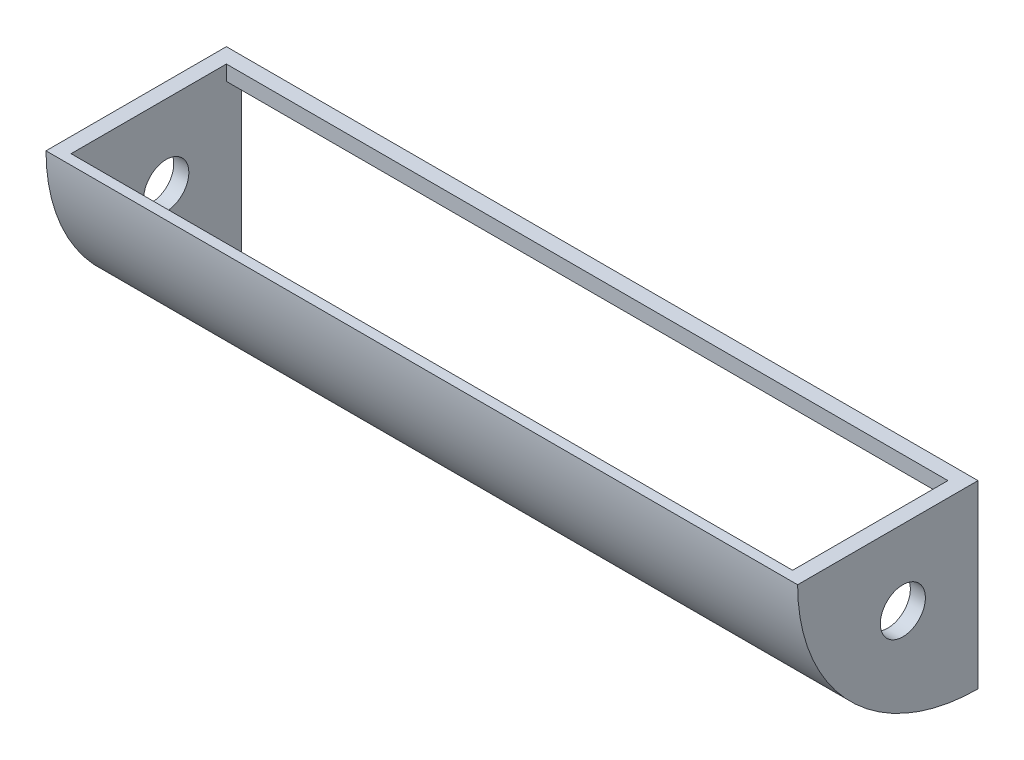
ISO-10303-21;
HEADER;
FILE_DESCRIPTION(('STEP AP214'),'2;1');
FILE_NAME('part.step','',(''),(''),'','','');
FILE_SCHEMA(('AUTOMOTIVE_DESIGN { 1 0 10303 214 1 1 1 1 }'));
ENDSEC;
DATA;
#1=APPLICATION_CONTEXT('core data for automotive mechanical design processes');
#2=APPLICATION_PROTOCOL_DEFINITION('international standard','automotive_design',2000,#1);
#3=PRODUCT_CONTEXT('',#1,'mechanical');
#4=PRODUCT('Part','Part','',(#3));
#5=PRODUCT_RELATED_PRODUCT_CATEGORY('part','',(#4));
#6=PRODUCT_DEFINITION_FORMATION('','',#4);
#7=PRODUCT_DEFINITION_CONTEXT('part definition',#1,'design');
#8=PRODUCT_DEFINITION('design','',#6,#7);
#9=PRODUCT_DEFINITION_SHAPE('','',#8);
#10=(LENGTH_UNIT() NAMED_UNIT(*) SI_UNIT(.MILLI.,.METRE.));
#11=(NAMED_UNIT(*) PLANE_ANGLE_UNIT() SI_UNIT($,.RADIAN.));
#12=(NAMED_UNIT(*) SI_UNIT($,.STERADIAN.) SOLID_ANGLE_UNIT());
#13=UNCERTAINTY_MEASURE_WITH_UNIT(LENGTH_MEASURE(1.E-05),#10,'distance_accuracy_value','');
#14=(GEOMETRIC_REPRESENTATION_CONTEXT(3) GLOBAL_UNCERTAINTY_ASSIGNED_CONTEXT((#13)) GLOBAL_UNIT_ASSIGNED_CONTEXT((#10,
#11,#12)) REPRESENTATION_CONTEXT('',''));
#15=CARTESIAN_POINT('',(0.,0.,0.));
#16=DIRECTION('',(0.,0.,1.));
#17=DIRECTION('',(1.,0.,0.));
#18=AXIS2_PLACEMENT_3D('',#15,#16,#17);
#19=CARTESIAN_POINT('',(25.4,0.,0.));
#20=DIRECTION('',(1.,0.,0.));
#21=DIRECTION('',(0.,0.,-1.));
#22=AXIS2_PLACEMENT_3D('',#19,#20,#21);
#23=PLANE('',#22);
#24=CARTESIAN_POINT('',(25.4,-127.,127.));
#25=DIRECTION('',(1.,0.,0.));
#26=DIRECTION('',(0.,0.,-1.));
#27=AXIS2_PLACEMENT_3D('',#24,#25,#26);
#28=CIRCLE('',#27,38.1);
#29=CARTESIAN_POINT('',(25.3999999999999,-127.,165.1));
#30=VERTEX_POINT('',#29);
#31=EDGE_CURVE('E159',#30,#30,#28,.T.);
#32=ORIENTED_EDGE('',*,*,#31,.F.);
#33=EDGE_LOOP('',(#32));
#34=FACE_BOUND('',#33,.T.);
#35=CARTESIAN_POINT('',(25.4,0.,0.));
#36=DIRECTION('',(-1.,0.,0.));
#37=DIRECTION('',(0.,0.,-1.));
#38=AXIS2_PLACEMENT_3D('',#35,#36,#37);
#39=CIRCLE('',#38,287.848767291767);
#40=CARTESIAN_POINT('',(25.4,-279.4,69.2282661301731));
#41=VERTEX_POINT('',#40);
#42=CARTESIAN_POINT('',(25.4,0.,287.848767291767));
#43=VERTEX_POINT('',#42);
#44=EDGE_CURVE('E48',#41,#43,#39,.T.);
#45=ORIENTED_EDGE('',*,*,#44,.F.);
#46=DIRECTION('',(0.,1.,0.));
#47=VECTOR('',#46,1.);
#48=CARTESIAN_POINT('',(25.4,-279.4,69.228266130173));
#49=LINE('',#48,#47);
#50=CARTESIAN_POINT('',(25.4,-296.834107151806,69.228266130173));
#51=VERTEX_POINT('',#50);
#52=EDGE_CURVE('E52',#51,#41,#49,.T.);
#53=ORIENTED_EDGE('',*,*,#52,.F.);
#54=CARTESIAN_POINT('',(25.4,0.,0.));
#55=DIRECTION('',(1.,0.,0.));
#56=DIRECTION('',(0.,0.,-1.));
#57=AXIS2_PLACEMENT_3D('',#54,#55,#56);
#58=CIRCLE('',#57,304.8);
#59=CARTESIAN_POINT('',(25.4,-304.8,0.));
#60=VERTEX_POINT('',#59);
#61=EDGE_CURVE('E191',#51,#60,#58,.T.);
#62=ORIENTED_EDGE('',*,*,#61,.T.);
#63=DIRECTION('',(0.,1.,0.));
#64=VECTOR('',#63,1.);
#65=CARTESIAN_POINT('',(25.4,0.,0.));
#66=LINE('',#65,#64);
#67=CARTESIAN_POINT('',(25.4,-25.4,0.));
#68=VERTEX_POINT('',#67);
#69=EDGE_CURVE('E186',#60,#68,#66,.T.);
#70=ORIENTED_EDGE('',*,*,#69,.T.);
#71=DIRECTION('',(0.,0.,-1.));
#72=VECTOR('',#71,1.);
#73=CARTESIAN_POINT('',(25.4,-25.4,0.));
#74=LINE('',#73,#72);
#75=CARTESIAN_POINT('',(25.4,-25.4,25.4));
#76=VERTEX_POINT('',#75);
#77=EDGE_CURVE('E174',#76,#68,#74,.T.);
#78=ORIENTED_EDGE('',*,*,#77,.F.);
#79=DIRECTION('',(0.,-1.,0.));
#80=VECTOR('',#79,1.);
#81=CARTESIAN_POINT('',(25.4,0.,25.4));
#82=LINE('',#81,#80);
#83=CARTESIAN_POINT('',(25.4,0.,25.4));
#84=VERTEX_POINT('',#83);
#85=EDGE_CURVE('E171',#84,#76,#82,.T.);
#86=ORIENTED_EDGE('',*,*,#85,.F.);
#87=DIRECTION('',(0.,0.,1.));
#88=VECTOR('',#87,1.);
#89=CARTESIAN_POINT('',(25.4,0.,0.));
#90=LINE('',#89,#88);
#91=EDGE_CURVE('E188',#84,#43,#90,.T.);
#92=ORIENTED_EDGE('',*,*,#91,.T.);
#93=EDGE_LOOP('',(#45,#53,#62,#70,#78,#86,#92));
#94=FACE_BOUND('',#93,.T.);
#95=ADVANCED_FACE('F33',(#34,#94),#23,.T.);
#96=CARTESIAN_POINT('',(25.4,0.,0.));
#97=DIRECTION('',(0.,0.,1.));
#98=DIRECTION('',(1.,0.,0.));
#99=AXIS2_PLACEMENT_3D('',#96,#97,#98);
#100=PLANE('',#99);
#101=DIRECTION('',(0.,1.,0.));
#102=VECTOR('',#101,1.);
#103=CARTESIAN_POINT('',(0.,0.,0.));
#104=LINE('',#103,#102);
#105=CARTESIAN_POINT('',(0.,-304.8,0.));
#106=VERTEX_POINT('',#105);
#107=CARTESIAN_POINT('',(0.,0.,0.));
#108=VERTEX_POINT('',#107);
#109=EDGE_CURVE('E185',#106,#108,#104,.T.);
#110=ORIENTED_EDGE('',*,*,#109,.T.);
#111=DIRECTION('',(-1.,0.,0.));
#112=VECTOR('',#111,1.);
#113=CARTESIAN_POINT('',(25.4,0.,0.));
#114=LINE('',#113,#112);
#115=CARTESIAN_POINT('',(1270.,0.,0.));
#116=VERTEX_POINT('',#115);
#117=EDGE_CURVE('E11',#116,#108,#114,.T.);
#118=ORIENTED_EDGE('',*,*,#117,.F.);
#119=DIRECTION('',(0.,1.,0.));
#120=VECTOR('',#119,1.);
#121=CARTESIAN_POINT('',(1270.,0.,0.));
#122=LINE('',#121,#120);
#123=CARTESIAN_POINT('',(1270.,-304.8,0.));
#124=VERTEX_POINT('',#123);
#125=EDGE_CURVE('E127',#124,#116,#122,.T.);
#126=ORIENTED_EDGE('',*,*,#125,.F.);
#127=DIRECTION('',(1.,0.,0.));
#128=VECTOR('',#127,1.);
#129=CARTESIAN_POINT('',(1244.6,-304.8,0.));
#130=LINE('',#129,#128);
#131=CARTESIAN_POINT('',(1244.6,-304.8,0.));
#132=VERTEX_POINT('',#131);
#133=EDGE_CURVE('E111',#132,#124,#130,.T.);
#134=ORIENTED_EDGE('',*,*,#133,.F.);
#135=DIRECTION('',(0.,1.,0.));
#136=VECTOR('',#135,1.);
#137=CARTESIAN_POINT('',(1244.6,0.,0.));
#138=LINE('',#137,#136);
#139=CARTESIAN_POINT('',(1244.6,-25.4,0.));
#140=VERTEX_POINT('',#139);
#141=EDGE_CURVE('E120',#132,#140,#138,.T.);
#142=ORIENTED_EDGE('',*,*,#141,.T.);
#143=DIRECTION('',(-1.,0.,0.));
#144=VECTOR('',#143,1.);
#145=CARTESIAN_POINT('',(635.,-25.4,0.));
#146=LINE('',#145,#144);
#147=EDGE_CURVE('E177',#140,#68,#146,.T.);
#148=ORIENTED_EDGE('',*,*,#147,.T.);
#149=ORIENTED_EDGE('',*,*,#69,.F.);
#150=DIRECTION('',(-1.,0.,0.));
#151=VECTOR('',#150,1.);
#152=CARTESIAN_POINT('',(25.4,-304.8,0.));
#153=LINE('',#152,#151);
#154=EDGE_CURVE('E193',#60,#106,#153,.T.);
#155=ORIENTED_EDGE('',*,*,#154,.T.);
#156=EDGE_LOOP('',(#110,#118,#126,#134,#142,#148,#149,#155));
#157=FACE_BOUND('',#156,.T.);
#158=ADVANCED_FACE('F35',(#157),#100,.F.);
#159=CARTESIAN_POINT('',(25.4,0.,0.));
#160=DIRECTION('',(0.,-1.,0.));
#161=DIRECTION('',(0.,0.,-1.));
#162=AXIS2_PLACEMENT_3D('',#159,#160,#161);
#163=PLANE('',#162);
#164=DIRECTION('',(-1.,0.,0.));
#165=VECTOR('',#164,1.);
#166=CARTESIAN_POINT('',(635.,0.,25.4));
#167=LINE('',#166,#165);
#168=CARTESIAN_POINT('',(1244.6,0.,25.4));
#169=VERTEX_POINT('',#168);
#170=EDGE_CURVE('E182',#169,#84,#167,.T.);
#171=ORIENTED_EDGE('',*,*,#170,.F.);
#172=DIRECTION('',(0.,0.,1.));
#173=VECTOR('',#172,1.);
#174=CARTESIAN_POINT('',(1244.6,0.,0.));
#175=LINE('',#174,#173);
#176=CARTESIAN_POINT('',(1244.6,0.,287.848767291767));
#177=VERTEX_POINT('',#176);
#178=EDGE_CURVE('E119',#169,#177,#175,.T.);
#179=ORIENTED_EDGE('',*,*,#178,.T.);
#180=DIRECTION('',(-1.,0.,0.));
#181=VECTOR('',#180,1.);
#182=CARTESIAN_POINT('',(635.,0.,287.848767291767));
#183=LINE('',#182,#181);
#184=EDGE_CURVE('E164',#177,#43,#183,.T.);
#185=ORIENTED_EDGE('',*,*,#184,.T.);
#186=ORIENTED_EDGE('',*,*,#91,.F.);
#187=EDGE_LOOP('',(#171,#179,#185,#186));
#188=FACE_BOUND('',#187,.T.);
#189=DIRECTION('',(0.,0.,1.));
#190=VECTOR('',#189,1.);
#191=CARTESIAN_POINT('',(0.,0.,0.));
#192=LINE('',#191,#190);
#193=CARTESIAN_POINT('',(0.,0.,304.8));
#194=VERTEX_POINT('',#193);
#195=EDGE_CURVE('E195',#108,#194,#192,.T.);
#196=ORIENTED_EDGE('',*,*,#195,.T.);
#197=DIRECTION('',(-1.,0.,0.));
#198=VECTOR('',#197,1.);
#199=CARTESIAN_POINT('',(25.4,0.,304.8));
#200=LINE('',#199,#198);
#201=CARTESIAN_POINT('',(1270.,0.,304.8));
#202=VERTEX_POINT('',#201);
#203=EDGE_CURVE('E41',#202,#194,#200,.T.);
#204=ORIENTED_EDGE('',*,*,#203,.F.);
#205=DIRECTION('',(0.,0.,1.));
#206=VECTOR('',#205,1.);
#207=CARTESIAN_POINT('',(1270.,0.,0.));
#208=LINE('',#207,#206);
#209=EDGE_CURVE('E136',#116,#202,#208,.T.);
#210=ORIENTED_EDGE('',*,*,#209,.F.);
#211=ORIENTED_EDGE('',*,*,#117,.T.);
#212=EDGE_LOOP('',(#196,#204,#210,#211));
#213=FACE_BOUND('',#212,.T.);
#214=ADVANCED_FACE('F215',(#188,#213),#163,.F.);
#215=CARTESIAN_POINT('',(25.4,0.,0.));
#216=DIRECTION('',(-1.,0.,0.));
#217=DIRECTION('',(0.,0.,1.));
#218=AXIS2_PLACEMENT_3D('',#215,#216,#217);
#219=CYLINDRICAL_SURFACE('',#218,304.8);
#220=CARTESIAN_POINT('',(0.,0.,0.));
#221=DIRECTION('',(1.,0.,0.));
#222=DIRECTION('',(0.,0.,-1.));
#223=AXIS2_PLACEMENT_3D('',#220,#221,#222);
#224=CIRCLE('',#223,304.8);
#225=EDGE_CURVE('E189',#194,#106,#224,.T.);
#226=ORIENTED_EDGE('',*,*,#225,.T.);
#227=ORIENTED_EDGE('',*,*,#154,.F.);
#228=ORIENTED_EDGE('',*,*,#61,.F.);
#229=DIRECTION('',(-1.,0.,0.));
#230=VECTOR('',#229,1.);
#231=CARTESIAN_POINT('',(635.,-296.834107151806,69.228266130173));
#232=LINE('',#231,#230);
#233=CARTESIAN_POINT('',(1244.6,-296.834107151806,69.228266130173));
#234=VERTEX_POINT('',#233);
#235=EDGE_CURVE('E114',#234,#51,#232,.T.);
#236=ORIENTED_EDGE('',*,*,#235,.F.);
#237=CARTESIAN_POINT('',(1244.6,0.,0.));
#238=DIRECTION('',(1.,0.,0.));
#239=DIRECTION('',(0.,0.,-1.));
#240=AXIS2_PLACEMENT_3D('',#237,#238,#239);
#241=CIRCLE('',#240,304.8);
#242=EDGE_CURVE('E107',#234,#132,#241,.T.);
#243=ORIENTED_EDGE('',*,*,#242,.T.);
#244=ORIENTED_EDGE('',*,*,#133,.T.);
#245=CARTESIAN_POINT('',(1270.,0.,0.));
#246=DIRECTION('',(1.,0.,0.));
#247=DIRECTION('',(0.,0.,-1.));
#248=AXIS2_PLACEMENT_3D('',#245,#246,#247);
#249=CIRCLE('',#248,304.8);
#250=EDGE_CURVE('E139',#202,#124,#249,.T.);
#251=ORIENTED_EDGE('',*,*,#250,.F.);
#252=ORIENTED_EDGE('',*,*,#203,.T.);
#253=EDGE_LOOP('',(#226,#227,#228,#236,#243,#244,#251,#252));
#254=FACE_BOUND('',#253,.T.);
#255=ADVANCED_FACE('F109',(#254),#219,.T.);
#256=CARTESIAN_POINT('',(0.,0.,0.));
#257=DIRECTION('',(1.,0.,0.));
#258=DIRECTION('',(0.,0.,-1.));
#259=AXIS2_PLACEMENT_3D('',#256,#257,#258);
#260=PLANE('',#259);
#261=CARTESIAN_POINT('',(0.,-127.,127.));
#262=DIRECTION('',(-1.,0.,0.));
#263=DIRECTION('',(0.,0.,1.));
#264=AXIS2_PLACEMENT_3D('',#261,#262,#263);
#265=CIRCLE('',#264,38.1);
#266=CARTESIAN_POINT('',(0.,-127.,165.1));
#267=VERTEX_POINT('',#266);
#268=EDGE_CURVE('E156',#267,#267,#265,.T.);
#269=ORIENTED_EDGE('',*,*,#268,.F.);
#270=EDGE_LOOP('',(#269));
#271=FACE_BOUND('',#270,.T.);
#272=ORIENTED_EDGE('',*,*,#109,.F.);
#273=ORIENTED_EDGE('',*,*,#225,.F.);
#274=ORIENTED_EDGE('',*,*,#195,.F.);
#275=EDGE_LOOP('',(#272,#273,#274));
#276=FACE_BOUND('',#275,.T.);
#277=ADVANCED_FACE('F206',(#271,#276),#260,.F.);
#278=CARTESIAN_POINT('',(635.,0.,25.4));
#279=DIRECTION('',(0.,0.,-1.));
#280=DIRECTION('',(0.,1.,0.));
#281=AXIS2_PLACEMENT_3D('',#278,#279,#280);
#282=PLANE('',#281);
#283=ORIENTED_EDGE('',*,*,#85,.T.);
#284=DIRECTION('',(-1.,0.,0.));
#285=VECTOR('',#284,1.);
#286=CARTESIAN_POINT('',(635.,-25.4,25.4));
#287=LINE('',#286,#285);
#288=CARTESIAN_POINT('',(1244.6,-25.4,25.4));
#289=VERTEX_POINT('',#288);
#290=EDGE_CURVE('E179',#289,#76,#287,.T.);
#291=ORIENTED_EDGE('',*,*,#290,.F.);
#292=DIRECTION('',(0.,-1.,0.));
#293=VECTOR('',#292,1.);
#294=CARTESIAN_POINT('',(1244.6,0.,25.4));
#295=LINE('',#294,#293);
#296=EDGE_CURVE('E154',#169,#289,#295,.T.);
#297=ORIENTED_EDGE('',*,*,#296,.F.);
#298=ORIENTED_EDGE('',*,*,#170,.T.);
#299=EDGE_LOOP('',(#283,#291,#297,#298));
#300=FACE_BOUND('',#299,.T.);
#301=ADVANCED_FACE('F218',(#300),#282,.F.);
#302=CARTESIAN_POINT('',(635.,-25.4,0.));
#303=DIRECTION('',(0.,1.,0.));
#304=DIRECTION('',(0.,0.,1.));
#305=AXIS2_PLACEMENT_3D('',#302,#303,#304);
#306=PLANE('',#305);
#307=ORIENTED_EDGE('',*,*,#77,.T.);
#308=ORIENTED_EDGE('',*,*,#147,.F.);
#309=DIRECTION('',(0.,0.,-1.));
#310=VECTOR('',#309,1.);
#311=CARTESIAN_POINT('',(1244.6,-25.4,0.));
#312=LINE('',#311,#310);
#313=EDGE_CURVE('E135',#289,#140,#312,.T.);
#314=ORIENTED_EDGE('',*,*,#313,.F.);
#315=ORIENTED_EDGE('',*,*,#290,.T.);
#316=EDGE_LOOP('',(#307,#308,#314,#315));
#317=FACE_BOUND('',#316,.T.);
#318=ADVANCED_FACE('F220',(#317),#306,.F.);
#319=CARTESIAN_POINT('',(635.,-279.4,69.228266130173));
#320=DIRECTION('',(0.,0.,1.));
#321=DIRECTION('',(1.,0.,0.));
#322=AXIS2_PLACEMENT_3D('',#319,#320,#321);
#323=PLANE('',#322);
#324=ORIENTED_EDGE('',*,*,#52,.T.);
#325=DIRECTION('',(-1.,0.,0.));
#326=VECTOR('',#325,1.);
#327=CARTESIAN_POINT('',(635.,-279.4,69.2282661301731));
#328=LINE('',#327,#326);
#329=CARTESIAN_POINT('',(1244.6,-279.4,69.2282661301731));
#330=VERTEX_POINT('',#329);
#331=EDGE_CURVE('E167',#330,#41,#328,.T.);
#332=ORIENTED_EDGE('',*,*,#331,.F.);
#333=DIRECTION('',(0.,1.,0.));
#334=VECTOR('',#333,1.);
#335=CARTESIAN_POINT('',(1244.6,-279.4,69.228266130173));
#336=LINE('',#335,#334);
#337=EDGE_CURVE('E151',#234,#330,#336,.T.);
#338=ORIENTED_EDGE('',*,*,#337,.F.);
#339=ORIENTED_EDGE('',*,*,#235,.T.);
#340=EDGE_LOOP('',(#324,#332,#338,#339));
#341=FACE_BOUND('',#340,.T.);
#342=ADVANCED_FACE('F209',(#341),#323,.F.);
#343=CARTESIAN_POINT('',(635.,0.,0.));
#344=DIRECTION('',(-1.,0.,0.));
#345=DIRECTION('',(0.,0.,1.));
#346=AXIS2_PLACEMENT_3D('',#343,#344,#345);
#347=CYLINDRICAL_SURFACE('',#346,287.848767291767);
#348=ORIENTED_EDGE('',*,*,#44,.T.);
#349=ORIENTED_EDGE('',*,*,#184,.F.);
#350=CARTESIAN_POINT('',(1244.6,0.,0.));
#351=DIRECTION('',(-1.,0.,0.));
#352=DIRECTION('',(0.,0.,-1.));
#353=AXIS2_PLACEMENT_3D('',#350,#351,#352);
#354=CIRCLE('',#353,287.848767291767);
#355=EDGE_CURVE('E129',#330,#177,#354,.T.);
#356=ORIENTED_EDGE('',*,*,#355,.F.);
#357=ORIENTED_EDGE('',*,*,#331,.T.);
#358=EDGE_LOOP('',(#348,#349,#356,#357));
#359=FACE_BOUND('',#358,.T.);
#360=ADVANCED_FACE('F221',(#359),#347,.F.);
#361=CARTESIAN_POINT('',(609.6,-127.,127.));
#362=DIRECTION('',(-1.,0.,0.));
#363=DIRECTION('',(0.,0.,1.));
#364=AXIS2_PLACEMENT_3D('',#361,#362,#363);
#365=CYLINDRICAL_SURFACE('',#364,38.1);
#366=CARTESIAN_POINT('',(25.3999999999999,-127.,165.1));
#367=CARTESIAN_POINT('',(25.1354166666665,-127.,165.1));
#368=CARTESIAN_POINT('',(24.8708333333332,-127.,165.1));
#369=CARTESIAN_POINT('',(24.3416666666665,-127.,165.1));
#370=CARTESIAN_POINT('',(24.0770833333332,-127.,165.1));
#371=CARTESIAN_POINT('',(23.5479166666666,-127.,165.1));
#372=CARTESIAN_POINT('',(23.2833333333332,-127.,165.1));
#373=CARTESIAN_POINT('',(22.7541666666666,-127.,165.1));
#374=CARTESIAN_POINT('',(22.4895833333332,-127.,165.1));
#375=CARTESIAN_POINT('',(21.9604166666666,-127.,165.1));
#376=CARTESIAN_POINT('',(21.6958333333332,-127.,165.1));
#377=CARTESIAN_POINT('',(21.1666666666666,-127.,165.1));
#378=CARTESIAN_POINT('',(20.9020833333332,-127.,165.1));
#379=CARTESIAN_POINT('',(20.3729166666666,-127.,165.1));
#380=CARTESIAN_POINT('',(20.1083333333332,-127.,165.1));
#381=CARTESIAN_POINT('',(19.5791666666666,-127.,165.1));
#382=CARTESIAN_POINT('',(19.3145833333332,-127.,165.1));
#383=CARTESIAN_POINT('',(18.7854166666666,-127.,165.1));
#384=CARTESIAN_POINT('',(18.5208333333332,-127.,165.1));
#385=CARTESIAN_POINT('',(17.9916666666666,-127.,165.1));
#386=CARTESIAN_POINT('',(17.7270833333332,-127.,165.1));
#387=CARTESIAN_POINT('',(17.1979166666666,-127.,165.1));
#388=CARTESIAN_POINT('',(16.9333333333332,-127.,165.1));
#389=CARTESIAN_POINT('',(16.4041666666666,-127.,165.1));
#390=CARTESIAN_POINT('',(16.1395833333332,-127.,165.1));
#391=CARTESIAN_POINT('',(15.6104166666666,-127.,165.1));
#392=CARTESIAN_POINT('',(15.3458333333332,-127.,165.1));
#393=CARTESIAN_POINT('',(14.8166666666666,-127.,165.1));
#394=CARTESIAN_POINT('',(14.5520833333332,-127.,165.1));
#395=CARTESIAN_POINT('',(14.0229166666666,-127.,165.1));
#396=CARTESIAN_POINT('',(13.7583333333333,-127.,165.1));
#397=CARTESIAN_POINT('',(13.2291666666666,-127.,165.1));
#398=CARTESIAN_POINT('',(12.9645833333333,-127.,165.1));
#399=CARTESIAN_POINT('',(12.4354166666666,-127.,165.1));
#400=CARTESIAN_POINT('',(12.1708333333332,-127.,165.1));
#401=CARTESIAN_POINT('',(11.6416666666666,-127.,165.1));
#402=CARTESIAN_POINT('',(11.3770833333333,-127.,165.1));
#403=CARTESIAN_POINT('',(10.8479166666666,-127.,165.1));
#404=CARTESIAN_POINT('',(10.5833333333333,-127.,165.1));
#405=CARTESIAN_POINT('',(10.0541666666666,-127.,165.1));
#406=CARTESIAN_POINT('',(9.78958333333332,-127.,165.1));
#407=CARTESIAN_POINT('',(9.26041666666666,-127.,165.1));
#408=CARTESIAN_POINT('',(8.99583333333331,-127.,165.1));
#409=CARTESIAN_POINT('',(8.46666666666662,-127.,165.1));
#410=CARTESIAN_POINT('',(8.20208333333328,-127.,165.1));
#411=CARTESIAN_POINT('',(7.67291666666662,-127.,165.1));
#412=CARTESIAN_POINT('',(7.40833333333331,-127.,165.1));
#413=CARTESIAN_POINT('',(6.87916666666666,-127.,165.1));
#414=CARTESIAN_POINT('',(6.61458333333331,-127.,165.1));
#415=CARTESIAN_POINT('',(6.08541666666662,-127.,165.1));
#416=CARTESIAN_POINT('',(5.82083333333328,-127.,165.1));
#417=CARTESIAN_POINT('',(5.29166666666662,-127.,165.1));
#418=CARTESIAN_POINT('',(5.02708333333331,-127.,165.1));
#419=CARTESIAN_POINT('',(4.49791666666666,-127.,165.1));
#420=CARTESIAN_POINT('',(4.23333333333331,-127.,165.1));
#421=CARTESIAN_POINT('',(3.70416666666662,-127.,165.1));
#422=CARTESIAN_POINT('',(3.43958333333327,-127.,165.1));
#423=CARTESIAN_POINT('',(2.91041666666662,-127.,165.1));
#424=CARTESIAN_POINT('',(2.64583333333331,-127.,165.1));
#425=CARTESIAN_POINT('',(2.11666666666666,-127.,165.1));
#426=CARTESIAN_POINT('',(1.85208333333331,-127.,165.1));
#427=CARTESIAN_POINT('',(1.32291666666666,-127.,165.1));
#428=CARTESIAN_POINT('',(1.05833333333335,-127.,165.1));
#429=CARTESIAN_POINT('',(0.529166666666692,-127.,165.1));
#430=CARTESIAN_POINT('',(0.264583333333346,-127.,165.1));
#431=CARTESIAN_POINT('',(0.,-127.,165.1));
#432=B_SPLINE_CURVE_WITH_KNOTS('',3,(#366,#367,#368,#369,#370,#371,#372,#373,#374,#375,#376,
#377,#378,#379,#380,#381,#382,#383,#384,#385,#386,#387,#388,#389,#390,#391,#392,#393,#394,#395,
#396,#397,#398,#399,#400,#401,#402,#403,#404,#405,#406,#407,#408,#409,#410,#411,#412,#413,#414,
#415,#416,#417,#418,#419,#420,#421,#422,#423,#424,#425,#426,#427,#428,#429,#430,#431),
.UNSPECIFIED.,.F.,.F.,(4,2,2,2,2,2,2,2,2,2,2,2,2,2,2,2,2,2,2,2,2,2,2,2,2,2,2,2,2,2,2,2,4),(0.,
0.793750000000037,1.58749999999996,2.38125,3.17499999999993,3.96874999999997,4.7625,
5.55624999999993,6.34999999999997,7.14375,7.93749999999993,8.73124999999997,9.52500000000001,
10.3187499999999,11.1125,11.9062499999999,12.6999999999999,13.49375,14.2874999999999,
15.0812499999999,15.8749999999999,16.6687499999999,17.4624999999999,18.2562499999999,
19.0499999999999,19.8437499999999,20.6374999999999,21.4312499999999,22.2249999999999,
23.0187499999999,23.8124999999999,24.6062499999998,25.3999999999999),.UNSPECIFIED.);
#433=EDGE_CURVE('BSEAM223',#30,#267,#432,.T.);
#434=ORIENTED_EDGE('',*,*,#31,.T.);
#435=ORIENTED_EDGE('',*,*,#268,.T.);
#436=ORIENTED_EDGE('',*,*,#433,.T.);
#437=ORIENTED_EDGE('',*,*,#433,.F.);
#438=EDGE_LOOP('',(#434,#436,#435,#437));
#439=FACE_BOUND('',#438,.T.);
#440=ADVANCED_FACE('F223',(#439),#365,.F.);
#441=CARTESIAN_POINT('',(1244.6,0.,0.));
#442=DIRECTION('',(-1.,0.,0.));
#443=DIRECTION('',(0.,0.,-1.));
#444=AXIS2_PLACEMENT_3D('',#441,#442,#443);
#445=PLANE('',#444);
#446=CARTESIAN_POINT('',(1244.6,-127.,127.));
#447=DIRECTION('',(-1.,0.,0.));
#448=DIRECTION('',(0.,0.,1.));
#449=AXIS2_PLACEMENT_3D('',#446,#447,#448);
#450=CIRCLE('',#449,38.1);
#451=CARTESIAN_POINT('',(1244.6,-127.,88.9000000000001));
#452=VERTEX_POINT('',#451);
#453=EDGE_CURVE('E142',#452,#452,#450,.F.);
#454=ORIENTED_EDGE('',*,*,#453,.T.);
#455=EDGE_LOOP('',(#454));
#456=FACE_BOUND('',#455,.T.);
#457=ORIENTED_EDGE('',*,*,#296,.T.);
#458=ORIENTED_EDGE('',*,*,#313,.T.);
#459=ORIENTED_EDGE('',*,*,#141,.F.);
#460=ORIENTED_EDGE('',*,*,#242,.F.);
#461=ORIENTED_EDGE('',*,*,#337,.T.);
#462=ORIENTED_EDGE('',*,*,#355,.T.);
#463=ORIENTED_EDGE('',*,*,#178,.F.);
#464=EDGE_LOOP('',(#457,#458,#459,#460,#461,#462,#463));
#465=FACE_BOUND('',#464,.T.);
#466=ADVANCED_FACE('F133',(#456,#465),#445,.T.);
#467=CARTESIAN_POINT('',(1270.,0.,0.));
#468=DIRECTION('',(-1.,0.,0.));
#469=DIRECTION('',(0.,0.,-1.));
#470=AXIS2_PLACEMENT_3D('',#467,#468,#469);
#471=PLANE('',#470);
#472=CARTESIAN_POINT('',(1270.,-127.,127.));
#473=DIRECTION('',(-1.,0.,0.));
#474=DIRECTION('',(0.,0.,1.));
#475=AXIS2_PLACEMENT_3D('',#472,#473,#474);
#476=CIRCLE('',#475,38.1);
#477=CARTESIAN_POINT('',(1270.,-127.,88.9000000000001));
#478=VERTEX_POINT('',#477);
#479=EDGE_CURVE('E319',#478,#478,#476,.T.);
#480=ORIENTED_EDGE('',*,*,#479,.T.);
#481=EDGE_LOOP('',(#480));
#482=FACE_BOUND('',#481,.T.);
#483=ORIENTED_EDGE('',*,*,#125,.T.);
#484=ORIENTED_EDGE('',*,*,#209,.T.);
#485=ORIENTED_EDGE('',*,*,#250,.T.);
#486=EDGE_LOOP('',(#483,#484,#485));
#487=FACE_BOUND('',#486,.T.);
#488=ADVANCED_FACE('F290',(#482,#487),#471,.F.);
#489=CARTESIAN_POINT('',(660.4,-127.,127.));
#490=DIRECTION('',(1.,0.,0.));
#491=DIRECTION('',(0.,0.,-1.));
#492=AXIS2_PLACEMENT_3D('',#489,#490,#491);
#493=CYLINDRICAL_SURFACE('',#492,38.1);
#494=CARTESIAN_POINT('',(1244.6,-127.,88.9000000000001));
#495=CARTESIAN_POINT('',(1244.86458333333,-127.,88.9000000000001));
#496=CARTESIAN_POINT('',(1245.12916666667,-127.,88.9000000000001));
#497=CARTESIAN_POINT('',(1245.65833333333,-127.,88.9000000000001));
#498=CARTESIAN_POINT('',(1245.92291666667,-127.,88.9000000000001));
#499=CARTESIAN_POINT('',(1246.45208333333,-127.,88.9000000000001));
#500=CARTESIAN_POINT('',(1246.71666666667,-127.,88.9000000000001));
#501=CARTESIAN_POINT('',(1247.24583333333,-127.,88.9000000000001));
#502=CARTESIAN_POINT('',(1247.51041666667,-127.,88.9000000000001));
#503=CARTESIAN_POINT('',(1248.03958333333,-127.,88.9000000000001));
#504=CARTESIAN_POINT('',(1248.30416666667,-127.,88.9000000000001));
#505=CARTESIAN_POINT('',(1248.83333333333,-127.,88.9000000000001));
#506=CARTESIAN_POINT('',(1249.09791666667,-127.,88.9000000000001));
#507=CARTESIAN_POINT('',(1249.62708333333,-127.,88.9000000000001));
#508=CARTESIAN_POINT('',(1249.89166666667,-127.,88.9000000000001));
#509=CARTESIAN_POINT('',(1250.42083333333,-127.,88.9000000000001));
#510=CARTESIAN_POINT('',(1250.68541666667,-127.,88.9000000000001));
#511=CARTESIAN_POINT('',(1251.21458333333,-127.,88.9000000000001));
#512=CARTESIAN_POINT('',(1251.47916666667,-127.,88.9000000000001));
#513=CARTESIAN_POINT('',(1252.00833333333,-127.,88.9000000000001));
#514=CARTESIAN_POINT('',(1252.27291666667,-127.,88.9000000000001));
#515=CARTESIAN_POINT('',(1252.80208333333,-127.,88.9000000000001));
#516=CARTESIAN_POINT('',(1253.06666666667,-127.,88.9000000000001));
#517=CARTESIAN_POINT('',(1253.59583333333,-127.,88.9000000000001));
#518=CARTESIAN_POINT('',(1253.86041666667,-127.,88.9000000000001));
#519=CARTESIAN_POINT('',(1254.38958333333,-127.,88.9000000000001));
#520=CARTESIAN_POINT('',(1254.65416666667,-127.,88.9000000000001));
#521=CARTESIAN_POINT('',(1255.18333333333,-127.,88.9000000000001));
#522=CARTESIAN_POINT('',(1255.44791666667,-127.,88.9000000000001));
#523=CARTESIAN_POINT('',(1255.97708333333,-127.,88.9000000000001));
#524=CARTESIAN_POINT('',(1256.24166666667,-127.,88.9000000000001));
#525=CARTESIAN_POINT('',(1256.77083333333,-127.,88.9000000000001));
#526=CARTESIAN_POINT('',(1257.03541666667,-127.,88.9000000000001));
#527=CARTESIAN_POINT('',(1257.56458333333,-127.,88.9000000000001));
#528=CARTESIAN_POINT('',(1257.82916666667,-127.,88.9000000000001));
#529=CARTESIAN_POINT('',(1258.35833333333,-127.,88.9000000000001));
#530=CARTESIAN_POINT('',(1258.62291666667,-127.,88.9000000000001));
#531=CARTESIAN_POINT('',(1259.15208333333,-127.,88.9000000000001));
#532=CARTESIAN_POINT('',(1259.41666666667,-127.,88.9000000000001));
#533=CARTESIAN_POINT('',(1259.94583333333,-127.,88.9000000000001));
#534=CARTESIAN_POINT('',(1260.21041666667,-127.,88.9000000000001));
#535=CARTESIAN_POINT('',(1260.73958333333,-127.,88.9000000000001));
#536=CARTESIAN_POINT('',(1261.00416666667,-127.,88.9000000000001));
#537=CARTESIAN_POINT('',(1261.53333333333,-127.,88.9000000000001));
#538=CARTESIAN_POINT('',(1261.79791666667,-127.,88.9000000000001));
#539=CARTESIAN_POINT('',(1262.32708333333,-127.,88.9000000000001));
#540=CARTESIAN_POINT('',(1262.59166666667,-127.,88.9000000000001));
#541=CARTESIAN_POINT('',(1263.12083333333,-127.,88.9000000000001));
#542=CARTESIAN_POINT('',(1263.38541666667,-127.,88.9000000000001));
#543=CARTESIAN_POINT('',(1263.91458333333,-127.,88.9000000000001));
#544=CARTESIAN_POINT('',(1264.17916666667,-127.,88.9000000000001));
#545=CARTESIAN_POINT('',(1264.70833333333,-127.,88.9000000000001));
#546=CARTESIAN_POINT('',(1264.97291666667,-127.,88.9000000000001));
#547=CARTESIAN_POINT('',(1265.50208333333,-127.,88.9000000000001));
#548=CARTESIAN_POINT('',(1265.76666666667,-127.,88.9000000000001));
#549=CARTESIAN_POINT('',(1266.29583333333,-127.,88.9000000000001));
#550=CARTESIAN_POINT('',(1266.56041666667,-127.,88.9000000000001));
#551=CARTESIAN_POINT('',(1267.08958333333,-127.,88.9000000000001));
#552=CARTESIAN_POINT('',(1267.35416666667,-127.,88.9000000000001));
#553=CARTESIAN_POINT('',(1267.88333333333,-127.,88.9000000000001));
#554=CARTESIAN_POINT('',(1268.14791666667,-127.,88.9000000000001));
#555=CARTESIAN_POINT('',(1268.67708333333,-127.,88.9000000000001));
#556=CARTESIAN_POINT('',(1268.94166666667,-127.,88.9000000000001));
#557=CARTESIAN_POINT('',(1269.47083333333,-127.,88.9000000000001));
#558=CARTESIAN_POINT('',(1269.73541666667,-127.,88.9000000000001));
#559=CARTESIAN_POINT('',(1270.,-127.,88.9000000000001));
#560=B_SPLINE_CURVE_WITH_KNOTS('',3,(#494,#495,#496,#497,#498,#499,#500,#501,#502,#503,#504,
#505,#506,#507,#508,#509,#510,#511,#512,#513,#514,#515,#516,#517,#518,#519,#520,#521,#522,#523,
#524,#525,#526,#527,#528,#529,#530,#531,#532,#533,#534,#535,#536,#537,#538,#539,#540,#541,#542,
#543,#544,#545,#546,#547,#548,#549,#550,#551,#552,#553,#554,#555,#556,#557,#558,#559),
.UNSPECIFIED.,.F.,.F.,(4,2,2,2,2,2,2,2,2,2,2,2,2,2,2,2,2,2,2,2,2,2,2,2,2,2,2,2,2,2,2,2,4),(0.,
0.793749999999926,1.58750000000007,2.38125,3.17499999999993,3.96875000000008,4.7625,
5.55624999999993,6.35000000000008,7.14375000000023,7.93750000000015,8.73125000000008,
9.52500000000023,10.3187500000002,11.1125000000001,11.9062500000002,12.7000000000002,
13.4937500000001,14.2875000000002,15.0812500000002,15.8750000000001,16.6687500000002,
17.4625000000002,18.2562500000001,19.0500000000002,19.8437500000004,20.6375000000003,
21.4312500000002,22.2250000000004,23.0187500000003,23.8125000000002,24.6062500000004,
25.4000000000003),.UNSPECIFIED.);
#561=EDGE_CURVE('BSEAM300',#452,#478,#560,.T.);
#562=ORIENTED_EDGE('',*,*,#453,.F.);
#563=ORIENTED_EDGE('',*,*,#479,.F.);
#564=ORIENTED_EDGE('',*,*,#561,.T.);
#565=ORIENTED_EDGE('',*,*,#561,.F.);
#566=EDGE_LOOP('',(#562,#564,#563,#565));
#567=FACE_BOUND('',#566,.T.);
#568=ADVANCED_FACE('F300',(#567),#493,.F.);
#569=CLOSED_SHELL('',(#95,#158,#214,#255,#277,#301,#318,#342,#360,#440,#466,#488,#568));
#570=MANIFOLD_SOLID_BREP('B2',#569);
#571=ADVANCED_BREP_SHAPE_REPRESENTATION('',(#18,#570),#14);
#572=SHAPE_DEFINITION_REPRESENTATION(#9,#571);
ENDSEC;
END-ISO-10303-21;
